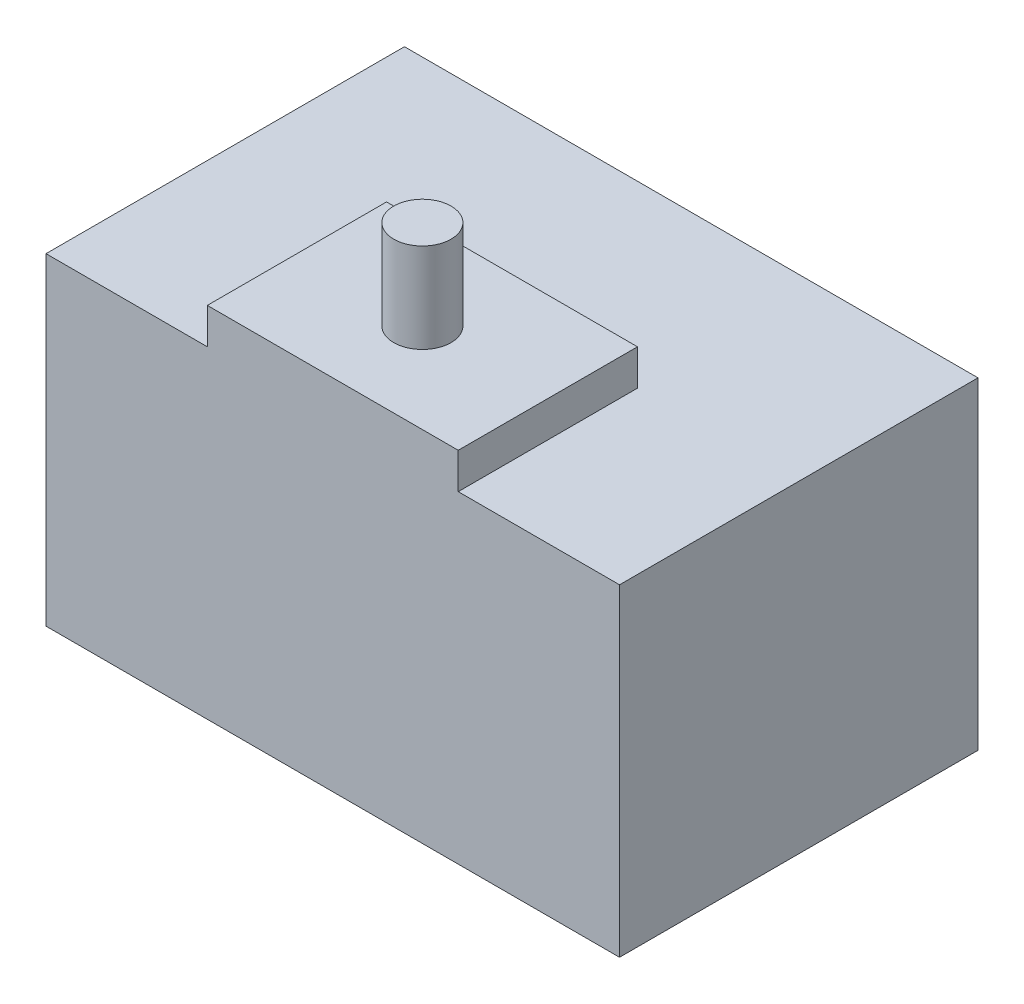
ISO-10303-21;
HEADER;
FILE_DESCRIPTION(('STEP AP214'),'2;1');
FILE_NAME('part.step','',(''),(''),'','','');
FILE_SCHEMA(('AUTOMOTIVE_DESIGN { 1 0 10303 214 1 1 1 1 }'));
ENDSEC;
DATA;
#1=APPLICATION_CONTEXT('core data for automotive mechanical design processes');
#2=APPLICATION_PROTOCOL_DEFINITION('international standard','automotive_design',2000,#1);
#3=PRODUCT_CONTEXT('',#1,'mechanical');
#4=PRODUCT('Part','Part','',(#3));
#5=PRODUCT_RELATED_PRODUCT_CATEGORY('part','',(#4));
#6=PRODUCT_DEFINITION_FORMATION('','',#4);
#7=PRODUCT_DEFINITION_CONTEXT('part definition',#1,'design');
#8=PRODUCT_DEFINITION('design','',#6,#7);
#9=PRODUCT_DEFINITION_SHAPE('','',#8);
#10=(LENGTH_UNIT() NAMED_UNIT(*) SI_UNIT(.MILLI.,.METRE.));
#11=(NAMED_UNIT(*) PLANE_ANGLE_UNIT() SI_UNIT($,.RADIAN.));
#12=(NAMED_UNIT(*) SI_UNIT($,.STERADIAN.) SOLID_ANGLE_UNIT());
#13=UNCERTAINTY_MEASURE_WITH_UNIT(LENGTH_MEASURE(1.E-05),#10,'distance_accuracy_value','');
#14=(GEOMETRIC_REPRESENTATION_CONTEXT(3) GLOBAL_UNCERTAINTY_ASSIGNED_CONTEXT((#13)) GLOBAL_UNIT_ASSIGNED_CONTEXT((#10,
#11,#12)) REPRESENTATION_CONTEXT('',''));
#15=CARTESIAN_POINT('',(0.,0.,0.));
#16=DIRECTION('',(0.,0.,1.));
#17=DIRECTION('',(1.,0.,0.));
#18=AXIS2_PLACEMENT_3D('',#15,#16,#17);
#19=CARTESIAN_POINT('',(800.,900.,-500.));
#20=DIRECTION('',(-1.,0.,0.));
#21=DIRECTION('',(0.,0.,1.));
#22=AXIS2_PLACEMENT_3D('',#19,#20,#21);
#23=PLANE('',#22);
#24=DIRECTION('',(0.,0.,-1.));
#25=VECTOR('',#24,1.);
#26=CARTESIAN_POINT('',(800.,0.,-500.));
#27=LINE('',#26,#25);
#28=CARTESIAN_POINT('',(800.,0.,500.));
#29=VERTEX_POINT('',#28);
#30=CARTESIAN_POINT('',(800.,0.,-500.));
#31=VERTEX_POINT('',#30);
#32=EDGE_CURVE('E120',#29,#31,#27,.T.);
#33=ORIENTED_EDGE('',*,*,#32,.T.);
#34=DIRECTION('',(0.,-1.,0.));
#35=VECTOR('',#34,1.);
#36=CARTESIAN_POINT('',(800.,900.,-500.));
#37=LINE('',#36,#35);
#38=CARTESIAN_POINT('',(800.,900.,-500.));
#39=VERTEX_POINT('',#38);
#40=EDGE_CURVE('E38',#39,#31,#37,.T.);
#41=ORIENTED_EDGE('',*,*,#40,.F.);
#42=DIRECTION('',(0.,0.,-1.));
#43=VECTOR('',#42,1.);
#44=CARTESIAN_POINT('',(800.,900.,-500.));
#45=LINE('',#44,#43);
#46=CARTESIAN_POINT('',(800.,900.,500.));
#47=VERTEX_POINT('',#46);
#48=EDGE_CURVE('E129',#47,#39,#45,.T.);
#49=ORIENTED_EDGE('',*,*,#48,.F.);
#50=DIRECTION('',(0.,-1.,0.));
#51=VECTOR('',#50,1.);
#52=CARTESIAN_POINT('',(800.,900.,500.));
#53=LINE('',#52,#51);
#54=EDGE_CURVE('E139',#47,#29,#53,.T.);
#55=ORIENTED_EDGE('',*,*,#54,.T.);
#56=EDGE_LOOP('',(#33,#41,#49,#55));
#57=FACE_BOUND('',#56,.T.);
#58=ADVANCED_FACE('F35',(#57),#23,.F.);
#59=CARTESIAN_POINT('',(-800.,900.,-500.));
#60=DIRECTION('',(0.,0.,1.));
#61=DIRECTION('',(1.,0.,0.));
#62=AXIS2_PLACEMENT_3D('',#59,#60,#61);
#63=PLANE('',#62);
#64=DIRECTION('',(-1.,0.,0.));
#65=VECTOR('',#64,1.);
#66=CARTESIAN_POINT('',(-800.,0.,-500.));
#67=LINE('',#66,#65);
#68=CARTESIAN_POINT('',(-800.,0.,-500.));
#69=VERTEX_POINT('',#68);
#70=EDGE_CURVE('E123',#31,#69,#67,.T.);
#71=ORIENTED_EDGE('',*,*,#70,.T.);
#72=DIRECTION('',(0.,-1.,0.));
#73=VECTOR('',#72,1.);
#74=CARTESIAN_POINT('',(-800.,900.,-500.));
#75=LINE('',#74,#73);
#76=CARTESIAN_POINT('',(-800.,900.,-500.));
#77=VERTEX_POINT('',#76);
#78=EDGE_CURVE('E149',#77,#69,#75,.T.);
#79=ORIENTED_EDGE('',*,*,#78,.F.);
#80=DIRECTION('',(-1.,0.,0.));
#81=VECTOR('',#80,1.);
#82=CARTESIAN_POINT('',(-800.,900.,-500.));
#83=LINE('',#82,#81);
#84=EDGE_CURVE('E132',#39,#77,#83,.T.);
#85=ORIENTED_EDGE('',*,*,#84,.F.);
#86=ORIENTED_EDGE('',*,*,#40,.T.);
#87=EDGE_LOOP('',(#71,#79,#85,#86));
#88=FACE_BOUND('',#87,.T.);
#89=ADVANCED_FACE('F158',(#88),#63,.F.);
#90=CARTESIAN_POINT('',(-800.,900.,-500.));
#91=DIRECTION('',(1.,0.,0.));
#92=DIRECTION('',(0.,0.,-1.));
#93=AXIS2_PLACEMENT_3D('',#90,#91,#92);
#94=PLANE('',#93);
#95=DIRECTION('',(0.,0.,1.));
#96=VECTOR('',#95,1.);
#97=CARTESIAN_POINT('',(-800.,0.,-500.));
#98=LINE('',#97,#96);
#99=CARTESIAN_POINT('',(-800.,0.,500.));
#100=VERTEX_POINT('',#99);
#101=EDGE_CURVE('E142',#69,#100,#98,.T.);
#102=ORIENTED_EDGE('',*,*,#101,.T.);
#103=DIRECTION('',(0.,-1.,0.));
#104=VECTOR('',#103,1.);
#105=CARTESIAN_POINT('',(-800.,900.,500.));
#106=LINE('',#105,#104);
#107=CARTESIAN_POINT('',(-800.,900.,500.));
#108=VERTEX_POINT('',#107);
#109=EDGE_CURVE('E147',#108,#100,#106,.T.);
#110=ORIENTED_EDGE('',*,*,#109,.F.);
#111=DIRECTION('',(0.,0.,1.));
#112=VECTOR('',#111,1.);
#113=CARTESIAN_POINT('',(-800.,900.,-500.));
#114=LINE('',#113,#112);
#115=EDGE_CURVE('E135',#77,#108,#114,.T.);
#116=ORIENTED_EDGE('',*,*,#115,.F.);
#117=ORIENTED_EDGE('',*,*,#78,.T.);
#118=EDGE_LOOP('',(#102,#110,#116,#117));
#119=FACE_BOUND('',#118,.T.);
#120=ADVANCED_FACE('F167',(#119),#94,.F.);
#121=CARTESIAN_POINT('',(-800.,900.,500.));
#122=DIRECTION('',(0.,0.,-1.));
#123=DIRECTION('',(-1.,0.,0.));
#124=AXIS2_PLACEMENT_3D('',#121,#122,#123);
#125=PLANE('',#124);
#126=DIRECTION('',(1.,0.,0.));
#127=VECTOR('',#126,1.);
#128=CARTESIAN_POINT('',(-800.,0.,500.));
#129=LINE('',#128,#127);
#130=EDGE_CURVE('E133',#100,#29,#129,.T.);
#131=ORIENTED_EDGE('',*,*,#130,.T.);
#132=ORIENTED_EDGE('',*,*,#54,.F.);
#133=DIRECTION('',(1.,0.,0.));
#134=VECTOR('',#133,1.);
#135=CARTESIAN_POINT('',(-800.,900.,500.));
#136=LINE('',#135,#134);
#137=CARTESIAN_POINT('',(350.,900.,500.));
#138=VERTEX_POINT('',#137);
#139=EDGE_CURVE('E137',#138,#47,#136,.T.);
#140=ORIENTED_EDGE('',*,*,#139,.F.);
#141=DIRECTION('',(0.,-1.,0.));
#142=VECTOR('',#141,1.);
#143=CARTESIAN_POINT('',(350.,1000.,500.));
#144=LINE('',#143,#142);
#145=CARTESIAN_POINT('',(350.,1000.,500.));
#146=VERTEX_POINT('',#145);
#147=EDGE_CURVE('E181',#146,#138,#144,.T.);
#148=ORIENTED_EDGE('',*,*,#147,.F.);
#149=DIRECTION('',(1.,0.,0.));
#150=VECTOR('',#149,1.);
#151=CARTESIAN_POINT('',(-350.,1000.,500.));
#152=LINE('',#151,#150);
#153=CARTESIAN_POINT('',(-350.,1000.,500.));
#154=VERTEX_POINT('',#153);
#155=EDGE_CURVE('E113',#154,#146,#152,.T.);
#156=ORIENTED_EDGE('',*,*,#155,.F.);
#157=DIRECTION('',(0.,-1.,0.));
#158=VECTOR('',#157,1.);
#159=CARTESIAN_POINT('',(-350.,1000.,500.));
#160=LINE('',#159,#158);
#161=CARTESIAN_POINT('',(-350.,900.,500.));
#162=VERTEX_POINT('',#161);
#163=EDGE_CURVE('E125',#154,#162,#160,.T.);
#164=ORIENTED_EDGE('',*,*,#163,.T.);
#165=EDGE_CURVE('E138',#108,#162,#136,.T.);
#166=ORIENTED_EDGE('',*,*,#165,.F.);
#167=ORIENTED_EDGE('',*,*,#109,.T.);
#168=EDGE_LOOP('',(#131,#132,#140,#148,#156,#164,#166,#167));
#169=FACE_BOUND('',#168,.T.);
#170=ADVANCED_FACE('F170',(#169),#125,.F.);
#171=CARTESIAN_POINT('',(0.,900.,0.));
#172=DIRECTION('',(0.,1.,0.));
#173=DIRECTION('',(0.,0.,1.));
#174=AXIS2_PLACEMENT_3D('',#171,#172,#173);
#175=PLANE('',#174);
#176=DIRECTION('',(0.,0.,-1.));
#177=VECTOR('',#176,1.);
#178=CARTESIAN_POINT('',(350.,900.,0.));
#179=LINE('',#178,#177);
#180=CARTESIAN_POINT('',(350.,900.,0.));
#181=VERTEX_POINT('',#180);
#182=EDGE_CURVE('E55',#138,#181,#179,.T.);
#183=ORIENTED_EDGE('',*,*,#182,.F.);
#184=ORIENTED_EDGE('',*,*,#139,.T.);
#185=ORIENTED_EDGE('',*,*,#48,.T.);
#186=ORIENTED_EDGE('',*,*,#84,.T.);
#187=ORIENTED_EDGE('',*,*,#115,.T.);
#188=ORIENTED_EDGE('',*,*,#165,.T.);
#189=DIRECTION('',(0.,0.,1.));
#190=VECTOR('',#189,1.);
#191=CARTESIAN_POINT('',(-350.,900.,0.));
#192=LINE('',#191,#190);
#193=CARTESIAN_POINT('',(-350.,900.,0.));
#194=VERTEX_POINT('',#193);
#195=EDGE_CURVE('E117',#194,#162,#192,.T.);
#196=ORIENTED_EDGE('',*,*,#195,.F.);
#197=DIRECTION('',(-1.,0.,0.));
#198=VECTOR('',#197,1.);
#199=CARTESIAN_POINT('',(-350.,900.,0.));
#200=LINE('',#199,#198);
#201=EDGE_CURVE('E50',#181,#194,#200,.T.);
#202=ORIENTED_EDGE('',*,*,#201,.F.);
#203=EDGE_LOOP('',(#183,#184,#185,#186,#187,#188,#196,#202));
#204=FACE_BOUND('',#203,.T.);
#205=ADVANCED_FACE('F174',(#204),#175,.T.);
#206=CARTESIAN_POINT('',(0.,0.,0.));
#207=DIRECTION('',(0.,1.,0.));
#208=DIRECTION('',(0.,0.,1.));
#209=AXIS2_PLACEMENT_3D('',#206,#207,#208);
#210=PLANE('',#209);
#211=ORIENTED_EDGE('',*,*,#32,.F.);
#212=ORIENTED_EDGE('',*,*,#130,.F.);
#213=ORIENTED_EDGE('',*,*,#101,.F.);
#214=ORIENTED_EDGE('',*,*,#70,.F.);
#215=EDGE_LOOP('',(#211,#212,#213,#214));
#216=FACE_BOUND('',#215,.T.);
#217=ADVANCED_FACE('F165',(#216),#210,.F.);
#218=CARTESIAN_POINT('',(350.,1000.,0.));
#219=DIRECTION('',(-1.,0.,0.));
#220=DIRECTION('',(0.,0.,1.));
#221=AXIS2_PLACEMENT_3D('',#218,#219,#220);
#222=PLANE('',#221);
#223=ORIENTED_EDGE('',*,*,#182,.T.);
#224=DIRECTION('',(0.,-1.,0.));
#225=VECTOR('',#224,1.);
#226=CARTESIAN_POINT('',(350.,1000.,0.));
#227=LINE('',#226,#225);
#228=CARTESIAN_POINT('',(350.,1000.,0.));
#229=VERTEX_POINT('',#228);
#230=EDGE_CURVE('E102',#229,#181,#227,.T.);
#231=ORIENTED_EDGE('',*,*,#230,.F.);
#232=DIRECTION('',(0.,0.,-1.));
#233=VECTOR('',#232,1.);
#234=CARTESIAN_POINT('',(350.,1000.,0.));
#235=LINE('',#234,#233);
#236=EDGE_CURVE('E108',#146,#229,#235,.T.);
#237=ORIENTED_EDGE('',*,*,#236,.F.);
#238=ORIENTED_EDGE('',*,*,#147,.T.);
#239=EDGE_LOOP('',(#223,#231,#237,#238));
#240=FACE_BOUND('',#239,.T.);
#241=ADVANCED_FACE('F119',(#240),#222,.F.);
#242=CARTESIAN_POINT('',(-350.,1000.,0.));
#243=DIRECTION('',(0.,0.,1.));
#244=DIRECTION('',(1.,0.,0.));
#245=AXIS2_PLACEMENT_3D('',#242,#243,#244);
#246=PLANE('',#245);
#247=ORIENTED_EDGE('',*,*,#201,.T.);
#248=DIRECTION('',(0.,-1.,0.));
#249=VECTOR('',#248,1.);
#250=CARTESIAN_POINT('',(-350.,1000.,0.));
#251=LINE('',#250,#249);
#252=CARTESIAN_POINT('',(-350.,1000.,0.));
#253=VERTEX_POINT('',#252);
#254=EDGE_CURVE('E104',#253,#194,#251,.T.);
#255=ORIENTED_EDGE('',*,*,#254,.F.);
#256=DIRECTION('',(-1.,0.,0.));
#257=VECTOR('',#256,1.);
#258=CARTESIAN_POINT('',(-350.,1000.,0.));
#259=LINE('',#258,#257);
#260=EDGE_CURVE('E98',#229,#253,#259,.T.);
#261=ORIENTED_EDGE('',*,*,#260,.F.);
#262=ORIENTED_EDGE('',*,*,#230,.T.);
#263=EDGE_LOOP('',(#247,#255,#261,#262));
#264=FACE_BOUND('',#263,.T.);
#265=ADVANCED_FACE('F100',(#264),#246,.F.);
#266=CARTESIAN_POINT('',(-350.,1000.,0.));
#267=DIRECTION('',(1.,0.,0.));
#268=DIRECTION('',(0.,0.,-1.));
#269=AXIS2_PLACEMENT_3D('',#266,#267,#268);
#270=PLANE('',#269);
#271=ORIENTED_EDGE('',*,*,#195,.T.);
#272=ORIENTED_EDGE('',*,*,#163,.F.);
#273=DIRECTION('',(0.,0.,1.));
#274=VECTOR('',#273,1.);
#275=CARTESIAN_POINT('',(-350.,1000.,0.));
#276=LINE('',#275,#274);
#277=EDGE_CURVE('E107',#253,#154,#276,.T.);
#278=ORIENTED_EDGE('',*,*,#277,.F.);
#279=ORIENTED_EDGE('',*,*,#254,.T.);
#280=EDGE_LOOP('',(#271,#272,#278,#279));
#281=FACE_BOUND('',#280,.T.);
#282=ADVANCED_FACE('F176',(#281),#270,.F.);
#283=CARTESIAN_POINT('',(0.,1000.,0.));
#284=DIRECTION('',(0.,1.,0.));
#285=DIRECTION('',(0.,0.,1.));
#286=AXIS2_PLACEMENT_3D('',#283,#284,#285);
#287=PLANE('',#286);
#288=CARTESIAN_POINT('',(0.,1000.,250.));
#289=DIRECTION('',(0.,1.,0.));
#290=DIRECTION('',(0.,0.,1.));
#291=AXIS2_PLACEMENT_3D('',#288,#289,#290);
#292=CIRCLE('',#291,80.);
#293=CARTESIAN_POINT('',(0.,1000.,330.));
#294=VERTEX_POINT('',#293);
#295=EDGE_CURVE('E11',#294,#294,#292,.T.);
#296=ORIENTED_EDGE('',*,*,#295,.F.);
#297=EDGE_LOOP('',(#296));
#298=FACE_BOUND('',#297,.T.);
#299=ORIENTED_EDGE('',*,*,#236,.T.);
#300=ORIENTED_EDGE('',*,*,#260,.T.);
#301=ORIENTED_EDGE('',*,*,#277,.T.);
#302=ORIENTED_EDGE('',*,*,#155,.T.);
#303=EDGE_LOOP('',(#299,#300,#301,#302));
#304=FACE_BOUND('',#303,.T.);
#305=ADVANCED_FACE('F111',(#298,#304),#287,.T.);
#306=CARTESIAN_POINT('',(0.,1250.,250.));
#307=DIRECTION('',(0.,-1.,0.));
#308=DIRECTION('',(0.,0.,-1.));
#309=AXIS2_PLACEMENT_3D('',#306,#307,#308);
#310=CYLINDRICAL_SURFACE('',#309,80.);
#311=CARTESIAN_POINT('',(0.,1250.,250.));
#312=DIRECTION('',(0.,1.,0.));
#313=DIRECTION('',(0.,0.,1.));
#314=AXIS2_PLACEMENT_3D('',#311,#312,#313);
#315=CIRCLE('',#314,80.);
#316=CARTESIAN_POINT('',(0.,1250.,330.));
#317=VERTEX_POINT('',#316);
#318=EDGE_CURVE('E184',#317,#317,#315,.T.);
#319=ORIENTED_EDGE('',*,*,#318,.F.);
#320=EDGE_LOOP('',(#319));
#321=FACE_BOUND('',#320,.T.);
#322=ORIENTED_EDGE('',*,*,#295,.T.);
#323=EDGE_LOOP('',(#322));
#324=FACE_BOUND('',#323,.T.);
#325=ADVANCED_FACE('F191',(#321,#324),#310,.T.);
#326=CARTESIAN_POINT('',(0.,1250.,250.));
#327=DIRECTION('',(0.,1.,0.));
#328=DIRECTION('',(0.,0.,1.));
#329=AXIS2_PLACEMENT_3D('',#326,#327,#328);
#330=PLANE('',#329);
#331=ORIENTED_EDGE('',*,*,#318,.T.);
#332=EDGE_LOOP('',(#331));
#333=FACE_BOUND('',#332,.T.);
#334=ADVANCED_FACE('F189',(#333),#330,.T.);
#335=CLOSED_SHELL('',(#58,#89,#120,#170,#205,#217,#241,#265,#282,#305,#325,#334));
#336=MANIFOLD_SOLID_BREP('B2',#335);
#337=ADVANCED_BREP_SHAPE_REPRESENTATION('',(#18,#336),#14);
#338=SHAPE_DEFINITION_REPRESENTATION(#9,#337);
ENDSEC;
END-ISO-10303-21;
